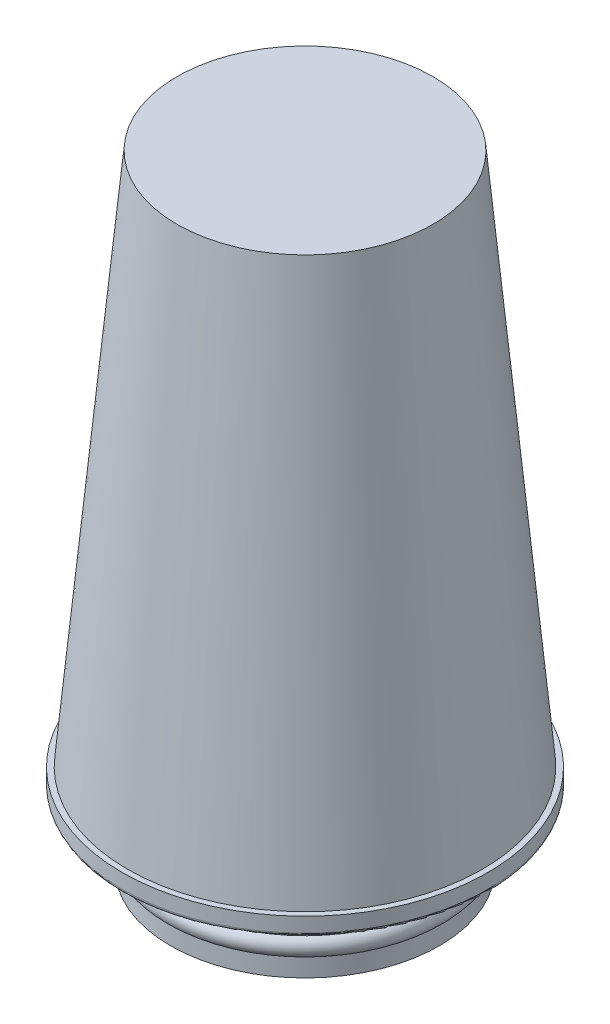
ISO-10303-21;
HEADER;
FILE_DESCRIPTION(('STEP AP214'),'2;1');
FILE_NAME('part.step','',(''),(''),'','','');
FILE_SCHEMA(('AUTOMOTIVE_DESIGN { 1 0 10303 214 1 1 1 1 }'));
ENDSEC;
DATA;
#1=APPLICATION_CONTEXT('core data for automotive mechanical design processes');
#2=APPLICATION_PROTOCOL_DEFINITION('international standard','automotive_design',2000,#1);
#3=PRODUCT_CONTEXT('',#1,'mechanical');
#4=PRODUCT('Part','Part','',(#3));
#5=PRODUCT_RELATED_PRODUCT_CATEGORY('part','',(#4));
#6=PRODUCT_DEFINITION_FORMATION('','',#4);
#7=PRODUCT_DEFINITION_CONTEXT('part definition',#1,'design');
#8=PRODUCT_DEFINITION('design','',#6,#7);
#9=PRODUCT_DEFINITION_SHAPE('','',#8);
#10=(LENGTH_UNIT() NAMED_UNIT(*) SI_UNIT(.MILLI.,.METRE.));
#11=(NAMED_UNIT(*) PLANE_ANGLE_UNIT() SI_UNIT($,.RADIAN.));
#12=(NAMED_UNIT(*) SI_UNIT($,.STERADIAN.) SOLID_ANGLE_UNIT());
#13=UNCERTAINTY_MEASURE_WITH_UNIT(LENGTH_MEASURE(1.E-05),#10,'distance_accuracy_value','');
#14=(GEOMETRIC_REPRESENTATION_CONTEXT(3) GLOBAL_UNCERTAINTY_ASSIGNED_CONTEXT((#13)) GLOBAL_UNIT_ASSIGNED_CONTEXT((#10,
#11,#12)) REPRESENTATION_CONTEXT('',''));
#15=CARTESIAN_POINT('',(0.,0.,0.));
#16=DIRECTION('',(0.,0.,1.));
#17=DIRECTION('',(1.,0.,0.));
#18=AXIS2_PLACEMENT_3D('',#15,#16,#17);
#19=CARTESIAN_POINT('',(0.,18.,0.));
#20=DIRECTION('',(0.,1.,0.));
#21=DIRECTION('',(0.,0.,1.));
#22=AXIS2_PLACEMENT_3D('',#19,#20,#21);
#23=TOROIDAL_SURFACE('',#22,37.75,2.5);
#24=CARTESIAN_POINT('',(0.,20.5,0.));
#25=DIRECTION('',(0.,1.,0.));
#26=DIRECTION('',(0.,0.,1.));
#27=AXIS2_PLACEMENT_3D('',#24,#25,#26);
#28=CIRCLE('',#27,37.75);
#29=CARTESIAN_POINT('',(0.,20.5,37.75));
#30=VERTEX_POINT('',#29);
#31=EDGE_CURVE('E86',#30,#30,#28,.T.);
#32=ORIENTED_EDGE('',*,*,#31,.T.);
#33=EDGE_LOOP('',(#32));
#34=FACE_BOUND('',#33,.T.);
#35=CARTESIAN_POINT('',(0.,18.,0.));
#36=DIRECTION('',(0.,1.,0.));
#37=DIRECTION('',(0.,0.,1.));
#38=AXIS2_PLACEMENT_3D('',#35,#36,#37);
#39=CIRCLE('',#38,35.25);
#40=CARTESIAN_POINT('',(0.,18.,35.25));
#41=VERTEX_POINT('',#40);
#42=EDGE_CURVE('E10',#41,#41,#39,.T.);
#43=ORIENTED_EDGE('',*,*,#42,.F.);
#44=EDGE_LOOP('',(#43));
#45=FACE_BOUND('',#44,.T.);
#46=ADVANCED_FACE('F34',(#34,#45),#23,.T.);
#47=CARTESIAN_POINT('',(0.,170.,0.));
#48=DIRECTION('',(0.,1.,0.));
#49=DIRECTION('',(0.,0.,1.));
#50=AXIS2_PLACEMENT_3D('',#47,#48,#49);
#51=CYLINDRICAL_SURFACE('',#50,35.25);
#52=ORIENTED_EDGE('',*,*,#42,.T.);
#53=EDGE_LOOP('',(#52));
#54=FACE_BOUND('',#53,.T.);
#55=CARTESIAN_POINT('',(0.,8.8228756555323,0.));
#56=DIRECTION('',(0.,1.,0.));
#57=DIRECTION('',(0.,0.,1.));
#58=AXIS2_PLACEMENT_3D('',#55,#56,#57);
#59=CIRCLE('',#58,35.25);
#60=CARTESIAN_POINT('',(0.,8.8228756555323,35.25));
#61=VERTEX_POINT('',#60);
#62=EDGE_CURVE('E40',#61,#61,#59,.T.);
#63=ORIENTED_EDGE('',*,*,#62,.F.);
#64=EDGE_LOOP('',(#63));
#65=FACE_BOUND('',#64,.T.);
#66=ADVANCED_FACE('F104',(#54,#65),#51,.F.);
#67=CARTESIAN_POINT('',(0.,7.5,0.));
#68=DIRECTION('',(0.,1.,0.));
#69=DIRECTION('',(0.,0.,1.));
#70=AXIS2_PLACEMENT_3D('',#67,#68,#69);
#71=TOROIDAL_SURFACE('',#70,35.4166666666667,1.33333333333333);
#72=ORIENTED_EDGE('',*,*,#62,.T.);
#73=EDGE_LOOP('',(#72));
#74=FACE_BOUND('',#73,.T.);
#75=CARTESIAN_POINT('',(0.,6.17712434446771,0.));
#76=DIRECTION('',(0.,1.,0.));
#77=DIRECTION('',(0.,0.,1.));
#78=AXIS2_PLACEMENT_3D('',#75,#76,#77);
#79=CIRCLE('',#78,35.25);
#80=CARTESIAN_POINT('',(0.,6.17712434446771,35.25));
#81=VERTEX_POINT('',#80);
#82=EDGE_CURVE('E44',#81,#81,#79,.T.);
#83=ORIENTED_EDGE('',*,*,#82,.F.);
#84=EDGE_LOOP('',(#83));
#85=FACE_BOUND('',#84,.T.);
#86=ADVANCED_FACE('F108',(#74,#85),#71,.F.);
#87=CARTESIAN_POINT('',(0.,170.,0.));
#88=DIRECTION('',(0.,1.,0.));
#89=DIRECTION('',(0.,0.,1.));
#90=AXIS2_PLACEMENT_3D('',#87,#88,#89);
#91=CYLINDRICAL_SURFACE('',#90,35.25);
#92=ORIENTED_EDGE('',*,*,#82,.T.);
#93=EDGE_LOOP('',(#92));
#94=FACE_BOUND('',#93,.T.);
#95=CARTESIAN_POINT('',(0.,0.,0.));
#96=DIRECTION('',(0.,1.,0.));
#97=DIRECTION('',(0.,0.,1.));
#98=AXIS2_PLACEMENT_3D('',#95,#96,#97);
#99=CIRCLE('',#98,35.25);
#100=CARTESIAN_POINT('',(0.,0.,35.25));
#101=VERTEX_POINT('',#100);
#102=EDGE_CURVE('E48',#101,#101,#99,.T.);
#103=ORIENTED_EDGE('',*,*,#102,.F.);
#104=EDGE_LOOP('',(#103));
#105=FACE_BOUND('',#104,.T.);
#106=ADVANCED_FACE('F112',(#94,#105),#91,.F.);
#107=CARTESIAN_POINT('',(21.0144105105647,0.,0.));
#108=DIRECTION('',(0.,1.,0.));
#109=DIRECTION('',(0.,0.,1.));
#110=AXIS2_PLACEMENT_3D('',#107,#108,#109);
#111=PLANE('',#110);
#112=CARTESIAN_POINT('',(0.,0.,0.));
#113=DIRECTION('',(0.,1.,0.));
#114=DIRECTION('',(0.,0.,1.));
#115=AXIS2_PLACEMENT_3D('',#112,#113,#114);
#116=CIRCLE('',#115,36.75);
#117=CARTESIAN_POINT('',(0.,0.,36.75));
#118=VERTEX_POINT('',#117);
#119=EDGE_CURVE('E53',#118,#118,#116,.T.);
#120=ORIENTED_EDGE('',*,*,#119,.F.);
#121=EDGE_LOOP('',(#120));
#122=FACE_BOUND('',#121,.T.);
#123=ORIENTED_EDGE('',*,*,#102,.T.);
#124=EDGE_LOOP('',(#123));
#125=FACE_BOUND('',#124,.T.);
#126=ADVANCED_FACE('F118',(#122,#125),#111,.F.);
#127=CARTESIAN_POINT('',(0.,170.,0.));
#128=DIRECTION('',(0.,1.,0.));
#129=DIRECTION('',(0.,0.,1.));
#130=AXIS2_PLACEMENT_3D('',#127,#128,#129);
#131=CYLINDRICAL_SURFACE('',#130,36.75);
#132=CARTESIAN_POINT('',(0.,5.,0.));
#133=DIRECTION('',(0.,1.,0.));
#134=DIRECTION('',(0.,0.,1.));
#135=AXIS2_PLACEMENT_3D('',#132,#133,#134);
#136=CIRCLE('',#135,36.75);
#137=CARTESIAN_POINT('',(0.,5.,36.75));
#138=VERTEX_POINT('',#137);
#139=EDGE_CURVE('E56',#138,#138,#136,.T.);
#140=ORIENTED_EDGE('',*,*,#139,.F.);
#141=EDGE_LOOP('',(#140));
#142=FACE_BOUND('',#141,.T.);
#143=ORIENTED_EDGE('',*,*,#119,.T.);
#144=EDGE_LOOP('',(#143));
#145=FACE_BOUND('',#144,.T.);
#146=ADVANCED_FACE('F122',(#142,#145),#131,.T.);
#147=CARTESIAN_POINT('',(0.,7.5,0.));
#148=DIRECTION('',(0.,1.,0.));
#149=DIRECTION('',(0.,0.,1.));
#150=AXIS2_PLACEMENT_3D('',#147,#148,#149);
#151=TOROIDAL_SURFACE('',#150,35.4166666666667,2.83333333333333);
#152=CARTESIAN_POINT('',(0.,10.,0.));
#153=DIRECTION('',(0.,1.,0.));
#154=DIRECTION('',(0.,0.,1.));
#155=AXIS2_PLACEMENT_3D('',#152,#153,#154);
#156=CIRCLE('',#155,36.75);
#157=CARTESIAN_POINT('',(0.,10.,36.75));
#158=VERTEX_POINT('',#157);
#159=EDGE_CURVE('E59',#158,#158,#156,.T.);
#160=ORIENTED_EDGE('',*,*,#159,.F.);
#161=EDGE_LOOP('',(#160));
#162=FACE_BOUND('',#161,.T.);
#163=ORIENTED_EDGE('',*,*,#139,.T.);
#164=EDGE_LOOP('',(#163));
#165=FACE_BOUND('',#164,.T.);
#166=ADVANCED_FACE('F126',(#162,#165),#151,.T.);
#167=CARTESIAN_POINT('',(0.,170.,0.));
#168=DIRECTION('',(0.,1.,0.));
#169=DIRECTION('',(0.,0.,1.));
#170=AXIS2_PLACEMENT_3D('',#167,#168,#169);
#171=CYLINDRICAL_SURFACE('',#170,36.75);
#172=CARTESIAN_POINT('',(0.,18.,0.));
#173=DIRECTION('',(0.,1.,0.));
#174=DIRECTION('',(0.,0.,1.));
#175=AXIS2_PLACEMENT_3D('',#172,#173,#174);
#176=CIRCLE('',#175,36.75);
#177=CARTESIAN_POINT('',(0.,18.,36.75));
#178=VERTEX_POINT('',#177);
#179=EDGE_CURVE('E62',#178,#178,#176,.T.);
#180=ORIENTED_EDGE('',*,*,#179,.F.);
#181=EDGE_LOOP('',(#180));
#182=FACE_BOUND('',#181,.T.);
#183=ORIENTED_EDGE('',*,*,#159,.T.);
#184=EDGE_LOOP('',(#183));
#185=FACE_BOUND('',#184,.T.);
#186=ADVANCED_FACE('F130',(#182,#185),#171,.T.);
#187=CARTESIAN_POINT('',(0.,18.,0.));
#188=DIRECTION('',(0.,1.,0.));
#189=DIRECTION('',(0.,0.,1.));
#190=AXIS2_PLACEMENT_3D('',#187,#188,#189);
#191=TOROIDAL_SURFACE('',#190,37.75,1.);
#192=CARTESIAN_POINT('',(0.,19.,0.));
#193=DIRECTION('',(0.,1.,0.));
#194=DIRECTION('',(0.,0.,1.));
#195=AXIS2_PLACEMENT_3D('',#192,#193,#194);
#196=CIRCLE('',#195,37.75);
#197=CARTESIAN_POINT('',(0.,19.,37.75));
#198=VERTEX_POINT('',#197);
#199=EDGE_CURVE('E65',#198,#198,#196,.T.);
#200=ORIENTED_EDGE('',*,*,#199,.F.);
#201=EDGE_LOOP('',(#200));
#202=FACE_BOUND('',#201,.T.);
#203=ORIENTED_EDGE('',*,*,#179,.T.);
#204=EDGE_LOOP('',(#203));
#205=FACE_BOUND('',#204,.T.);
#206=ADVANCED_FACE('F134',(#202,#205),#191,.F.);
#207=CARTESIAN_POINT('',(21.0144105105647,19.,0.));
#208=DIRECTION('',(0.,1.,0.));
#209=DIRECTION('',(0.,0.,1.));
#210=AXIS2_PLACEMENT_3D('',#207,#208,#209);
#211=PLANE('',#210);
#212=CARTESIAN_POINT('',(0.,19.,0.));
#213=DIRECTION('',(0.,1.,0.));
#214=DIRECTION('',(0.,0.,1.));
#215=AXIS2_PLACEMENT_3D('',#212,#213,#214);
#216=CIRCLE('',#215,49.);
#217=CARTESIAN_POINT('',(0.,19.,49.));
#218=VERTEX_POINT('',#217);
#219=EDGE_CURVE('E68',#218,#218,#216,.T.);
#220=ORIENTED_EDGE('',*,*,#219,.F.);
#221=EDGE_LOOP('',(#220));
#222=FACE_BOUND('',#221,.T.);
#223=ORIENTED_EDGE('',*,*,#199,.T.);
#224=EDGE_LOOP('',(#223));
#225=FACE_BOUND('',#224,.T.);
#226=ADVANCED_FACE('F138',(#222,#225),#211,.F.);
#227=CARTESIAN_POINT('',(0.,20.,0.));
#228=DIRECTION('',(0.,1.,0.));
#229=DIRECTION('',(0.,0.,1.));
#230=AXIS2_PLACEMENT_3D('',#227,#228,#229);
#231=TOROIDAL_SURFACE('',#230,49.,1.);
#232=CARTESIAN_POINT('',(0.,20.,0.));
#233=DIRECTION('',(0.,1.,0.));
#234=DIRECTION('',(0.,0.,1.));
#235=AXIS2_PLACEMENT_3D('',#232,#233,#234);
#236=CIRCLE('',#235,50.);
#237=CARTESIAN_POINT('',(0.,20.,50.));
#238=VERTEX_POINT('',#237);
#239=EDGE_CURVE('E71',#238,#238,#236,.T.);
#240=ORIENTED_EDGE('',*,*,#239,.F.);
#241=EDGE_LOOP('',(#240));
#242=FACE_BOUND('',#241,.T.);
#243=ORIENTED_EDGE('',*,*,#219,.T.);
#244=EDGE_LOOP('',(#243));
#245=FACE_BOUND('',#244,.T.);
#246=ADVANCED_FACE('F142',(#242,#245),#231,.T.);
#247=CARTESIAN_POINT('',(0.,170.,0.));
#248=DIRECTION('',(0.,1.,0.));
#249=DIRECTION('',(0.,0.,1.));
#250=AXIS2_PLACEMENT_3D('',#247,#248,#249);
#251=CYLINDRICAL_SURFACE('',#250,50.);
#252=CARTESIAN_POINT('',(0.,24.,0.));
#253=DIRECTION('',(0.,1.,0.));
#254=DIRECTION('',(0.,0.,1.));
#255=AXIS2_PLACEMENT_3D('',#252,#253,#254);
#256=CIRCLE('',#255,50.);
#257=CARTESIAN_POINT('',(0.,24.,50.));
#258=VERTEX_POINT('',#257);
#259=EDGE_CURVE('E74',#258,#258,#256,.T.);
#260=ORIENTED_EDGE('',*,*,#259,.F.);
#261=EDGE_LOOP('',(#260));
#262=FACE_BOUND('',#261,.T.);
#263=ORIENTED_EDGE('',*,*,#239,.T.);
#264=EDGE_LOOP('',(#263));
#265=FACE_BOUND('',#264,.T.);
#266=ADVANCED_FACE('F146',(#262,#265),#251,.T.);
#267=CARTESIAN_POINT('',(21.0144105105647,24.,0.));
#268=DIRECTION('',(0.,1.,0.));
#269=DIRECTION('',(0.,0.,1.));
#270=AXIS2_PLACEMENT_3D('',#267,#268,#269);
#271=PLANE('',#270);
#272=ORIENTED_EDGE('',*,*,#259,.T.);
#273=EDGE_LOOP('',(#272));
#274=FACE_BOUND('',#273,.T.);
#275=CARTESIAN_POINT('',(0.,24.,0.));
#276=DIRECTION('',(0.,1.,0.));
#277=DIRECTION('',(0.,0.,1.));
#278=AXIS2_PLACEMENT_3D('',#275,#276,#277);
#279=CIRCLE('',#278,48.5);
#280=CARTESIAN_POINT('',(0.,24.,48.5));
#281=VERTEX_POINT('',#280);
#282=EDGE_CURVE('E77',#281,#281,#279,.T.);
#283=ORIENTED_EDGE('',*,*,#282,.F.);
#284=EDGE_LOOP('',(#283));
#285=FACE_BOUND('',#284,.T.);
#286=ADVANCED_FACE('F150',(#274,#285),#271,.T.);
#287=CARTESIAN_POINT('',(0.,170.,0.));
#288=DIRECTION('',(0.,-1.,0.));
#289=DIRECTION('',(0.,0.,-1.));
#290=AXIS2_PLACEMENT_3D('',#287,#288,#289);
#291=CONICAL_SURFACE('',#290,35.,0.0922035722975013);
#292=ORIENTED_EDGE('',*,*,#282,.T.);
#293=EDGE_LOOP('',(#292));
#294=FACE_BOUND('',#293,.T.);
#295=CARTESIAN_POINT('',(0.,170.,0.));
#296=DIRECTION('',(0.,1.,0.));
#297=DIRECTION('',(0.,0.,1.));
#298=AXIS2_PLACEMENT_3D('',#295,#296,#297);
#299=CIRCLE('',#298,35.);
#300=CARTESIAN_POINT('',(0.,170.,35.));
#301=VERTEX_POINT('',#300);
#302=EDGE_CURVE('E80',#301,#301,#299,.T.);
#303=ORIENTED_EDGE('',*,*,#302,.F.);
#304=EDGE_LOOP('',(#303));
#305=FACE_BOUND('',#304,.T.);
#306=ADVANCED_FACE('F154',(#294,#305),#291,.T.);
#307=CARTESIAN_POINT('',(21.0144105105647,170.,0.));
#308=DIRECTION('',(0.,1.,0.));
#309=DIRECTION('',(0.,0.,1.));
#310=AXIS2_PLACEMENT_3D('',#307,#308,#309);
#311=PLANE('',#310);
#312=ORIENTED_EDGE('',*,*,#302,.T.);
#313=EDGE_LOOP('',(#312));
#314=FACE_BOUND('',#313,.T.);
#315=ADVANCED_FACE('F100',(#314),#311,.T.);
#316=CARTESIAN_POINT('',(21.0144105105647,159.,0.));
#317=DIRECTION('',(0.,-1.,0.));
#318=DIRECTION('',(0.,0.,-1.));
#319=AXIS2_PLACEMENT_3D('',#316,#317,#318);
#320=PLANE('',#319);
#321=CARTESIAN_POINT('',(0.,159.,0.));
#322=DIRECTION('',(0.,1.,0.));
#323=DIRECTION('',(0.,0.,1.));
#324=AXIS2_PLACEMENT_3D('',#321,#322,#323);
#325=CIRCLE('',#324,24.9434931506849);
#326=CARTESIAN_POINT('',(0.,159.,24.9434931506849));
#327=VERTEX_POINT('',#326);
#328=EDGE_CURVE('E83',#327,#327,#325,.T.);
#329=ORIENTED_EDGE('',*,*,#328,.F.);
#330=EDGE_LOOP('',(#329));
#331=FACE_BOUND('',#330,.T.);
#332=ADVANCED_FACE('F94',(#331),#320,.T.);
#333=CARTESIAN_POINT('',(0.,20.5,0.));
#334=DIRECTION('',(0.,-1.,0.));
#335=DIRECTION('',(0.,0.,-1.));
#336=AXIS2_PLACEMENT_3D('',#333,#334,#335);
#337=CONICAL_SURFACE('',#336,37.75,0.0922035722975015);
#338=ORIENTED_EDGE('',*,*,#328,.T.);
#339=EDGE_LOOP('',(#338));
#340=FACE_BOUND('',#339,.T.);
#341=ORIENTED_EDGE('',*,*,#31,.F.);
#342=EDGE_LOOP('',(#341));
#343=FACE_BOUND('',#342,.T.);
#344=ADVANCED_FACE('F92',(#340,#343),#337,.F.);
#345=CLOSED_SHELL('',(#46,#66,#86,#106,#126,#146,#166,#186,#206,#226,#246,#266,#286,#306,#315,
#332,#344));
#346=MANIFOLD_SOLID_BREP('B2',#345);
#347=ADVANCED_BREP_SHAPE_REPRESENTATION('',(#18,#346),#14);
#348=SHAPE_DEFINITION_REPRESENTATION(#9,#347);
ENDSEC;
END-ISO-10303-21;
